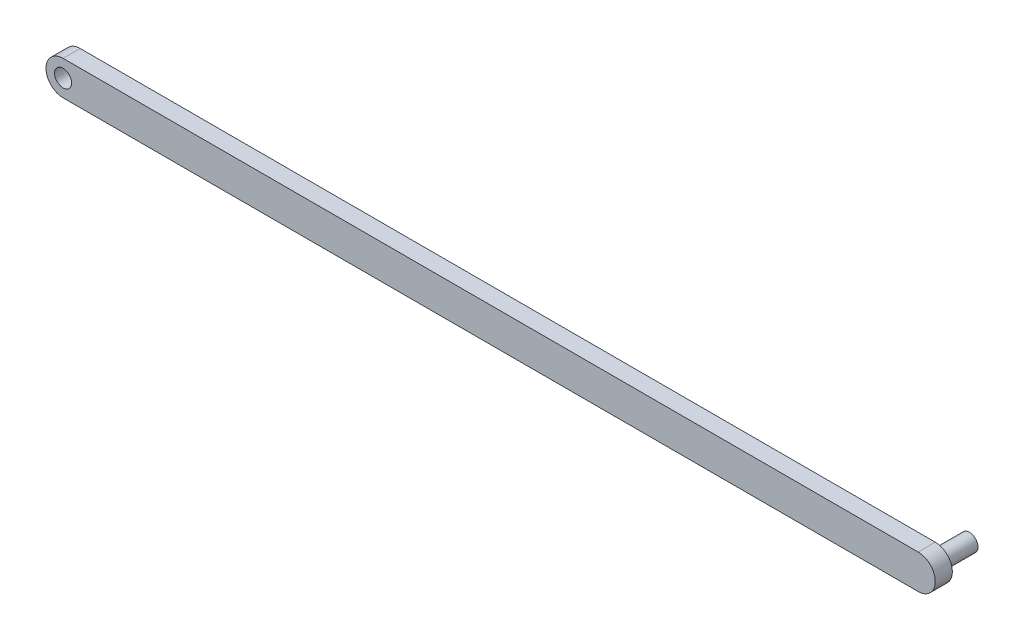
ISO-10303-21;
HEADER;
FILE_DESCRIPTION(('STEP AP214'),'2;1');
FILE_NAME('part.step','',(''),(''),'','','');
FILE_SCHEMA(('AUTOMOTIVE_DESIGN { 1 0 10303 214 1 1 1 1 }'));
ENDSEC;
DATA;
#1=APPLICATION_CONTEXT('core data for automotive mechanical design processes');
#2=APPLICATION_PROTOCOL_DEFINITION('international standard','automotive_design',2000,#1);
#3=PRODUCT_CONTEXT('',#1,'mechanical');
#4=PRODUCT('Part','Part','',(#3));
#5=PRODUCT_RELATED_PRODUCT_CATEGORY('part','',(#4));
#6=PRODUCT_DEFINITION_FORMATION('','',#4);
#7=PRODUCT_DEFINITION_CONTEXT('part definition',#1,'design');
#8=PRODUCT_DEFINITION('design','',#6,#7);
#9=PRODUCT_DEFINITION_SHAPE('','',#8);
#10=(LENGTH_UNIT() NAMED_UNIT(*) SI_UNIT(.MILLI.,.METRE.));
#11=(NAMED_UNIT(*) PLANE_ANGLE_UNIT() SI_UNIT($,.RADIAN.));
#12=(NAMED_UNIT(*) SI_UNIT($,.STERADIAN.) SOLID_ANGLE_UNIT());
#13=UNCERTAINTY_MEASURE_WITH_UNIT(LENGTH_MEASURE(1.E-05),#10,'distance_accuracy_value','');
#14=(GEOMETRIC_REPRESENTATION_CONTEXT(3) GLOBAL_UNCERTAINTY_ASSIGNED_CONTEXT((#13)) GLOBAL_UNIT_ASSIGNED_CONTEXT((#10,
#11,#12)) REPRESENTATION_CONTEXT('',''));
#15=CARTESIAN_POINT('',(0.,0.,0.));
#16=DIRECTION('',(0.,0.,1.));
#17=DIRECTION('',(1.,0.,0.));
#18=AXIS2_PLACEMENT_3D('',#15,#16,#17);
#19=CARTESIAN_POINT('',(-59.1400280952511,0.,0.));
#20=DIRECTION('',(0.,0.,1.));
#21=DIRECTION('',(1.,0.,0.));
#22=AXIS2_PLACEMENT_3D('',#19,#20,#21);
#23=PLANE('',#22);
#24=CARTESIAN_POINT('',(-59.1400280952511,0.,0.));
#25=DIRECTION('',(0.,0.,-1.));
#26=DIRECTION('',(-1.,0.,0.));
#27=AXIS2_PLACEMENT_3D('',#24,#25,#26);
#28=CIRCLE('',#27,0.999999999999998);
#29=CARTESIAN_POINT('',(-60.1400280952511,0.,0.));
#30=VERTEX_POINT('',#29);
#31=EDGE_CURVE('E198',#30,#30,#28,.T.);
#32=ORIENTED_EDGE('',*,*,#31,.F.);
#33=EDGE_LOOP('',(#32));
#34=FACE_BOUND('',#33,.T.);
#35=CARTESIAN_POINT('',(-59.1400280952511,0.,0.));
#36=DIRECTION('',(0.,0.,1.));
#37=DIRECTION('',(1.,0.,0.));
#38=AXIS2_PLACEMENT_3D('',#35,#36,#37);
#39=CIRCLE('',#38,2.);
#40=CARTESIAN_POINT('',(-59.1400280952511,2.,0.));
#41=VERTEX_POINT('',#40);
#42=CARTESIAN_POINT('',(-59.1400280952511,-2.,0.));
#43=VERTEX_POINT('',#42);
#44=EDGE_CURVE('E98',#41,#43,#39,.T.);
#45=ORIENTED_EDGE('',*,*,#44,.F.);
#46=DIRECTION('',(-1.,0.,0.));
#47=VECTOR('',#46,1.);
#48=CARTESIAN_POINT('',(-59.1400280952511,2.,0.));
#49=LINE('',#48,#47);
#50=CARTESIAN_POINT('',(40.8599719047489,2.,0.));
#51=VERTEX_POINT('',#50);
#52=EDGE_CURVE('E71',#51,#41,#49,.T.);
#53=ORIENTED_EDGE('',*,*,#52,.F.);
#54=CARTESIAN_POINT('',(40.8599719047489,0.,0.));
#55=DIRECTION('',(0.,0.,1.));
#56=DIRECTION('',(1.,0.,0.));
#57=AXIS2_PLACEMENT_3D('',#54,#55,#56);
#58=CIRCLE('',#57,2.);
#59=CARTESIAN_POINT('',(40.8599719047489,-2.,0.));
#60=VERTEX_POINT('',#59);
#61=EDGE_CURVE('E65',#60,#51,#58,.T.);
#62=ORIENTED_EDGE('',*,*,#61,.F.);
#63=DIRECTION('',(1.,0.,0.));
#64=VECTOR('',#63,1.);
#65=CARTESIAN_POINT('',(-59.1400280952511,-2.,0.));
#66=LINE('',#65,#64);
#67=EDGE_CURVE('E89',#43,#60,#66,.T.);
#68=ORIENTED_EDGE('',*,*,#67,.F.);
#69=EDGE_LOOP('',(#45,#53,#62,#68));
#70=FACE_BOUND('',#69,.T.);
#71=CARTESIAN_POINT('',(40.8599719047489,0.,0.));
#72=DIRECTION('',(0.,0.,1.));
#73=DIRECTION('',(1.,0.,0.));
#74=AXIS2_PLACEMENT_3D('',#71,#72,#73);
#75=CIRCLE('',#74,0.999999999999998);
#76=CARTESIAN_POINT('',(41.8599719047489,0.,0.));
#77=VERTEX_POINT('',#76);
#78=EDGE_CURVE('E11',#77,#77,#75,.F.);
#79=ORIENTED_EDGE('',*,*,#78,.F.);
#80=EDGE_LOOP('',(#79));
#81=FACE_BOUND('',#80,.T.);
#82=ADVANCED_FACE('F30',(#34,#70,#81),#23,.F.);
#83=CARTESIAN_POINT('',(-59.1400280952511,0.,2.));
#84=DIRECTION('',(0.,0.,-1.));
#85=DIRECTION('',(-1.,0.,0.));
#86=AXIS2_PLACEMENT_3D('',#83,#84,#85);
#87=CYLINDRICAL_SURFACE('',#86,2.);
#88=ORIENTED_EDGE('',*,*,#44,.T.);
#89=DIRECTION('',(0.,0.,-1.));
#90=VECTOR('',#89,1.);
#91=CARTESIAN_POINT('',(-59.1400280952511,-2.,2.));
#92=LINE('',#91,#90);
#93=CARTESIAN_POINT('',(-59.1400280952511,-2.,2.));
#94=VERTEX_POINT('',#93);
#95=EDGE_CURVE('E40',#94,#43,#92,.T.);
#96=ORIENTED_EDGE('',*,*,#95,.F.);
#97=CARTESIAN_POINT('',(-59.1400280952511,0.,2.));
#98=DIRECTION('',(0.,0.,1.));
#99=DIRECTION('',(1.,0.,0.));
#100=AXIS2_PLACEMENT_3D('',#97,#98,#99);
#101=CIRCLE('',#100,2.);
#102=CARTESIAN_POINT('',(-59.1400280952511,2.,2.));
#103=VERTEX_POINT('',#102);
#104=EDGE_CURVE('E84',#103,#94,#101,.T.);
#105=ORIENTED_EDGE('',*,*,#104,.F.);
#106=DIRECTION('',(0.,0.,-1.));
#107=VECTOR('',#106,1.);
#108=CARTESIAN_POINT('',(-59.1400280952511,2.,2.));
#109=LINE('',#108,#107);
#110=EDGE_CURVE('E94',#103,#41,#109,.T.);
#111=ORIENTED_EDGE('',*,*,#110,.T.);
#112=EDGE_LOOP('',(#88,#96,#105,#111));
#113=FACE_BOUND('',#112,.T.);
#114=ADVANCED_FACE('F32',(#113),#87,.T.);
#115=CARTESIAN_POINT('',(-59.1400280952511,-2.,2.));
#116=DIRECTION('',(0.,1.,0.));
#117=DIRECTION('',(0.,0.,1.));
#118=AXIS2_PLACEMENT_3D('',#115,#116,#117);
#119=PLANE('',#118);
#120=ORIENTED_EDGE('',*,*,#67,.T.);
#121=DIRECTION('',(0.,0.,-1.));
#122=VECTOR('',#121,1.);
#123=CARTESIAN_POINT('',(40.8599719047489,-2.,2.));
#124=LINE('',#123,#122);
#125=CARTESIAN_POINT('',(40.8599719047489,-2.,2.));
#126=VERTEX_POINT('',#125);
#127=EDGE_CURVE('E87',#126,#60,#124,.T.);
#128=ORIENTED_EDGE('',*,*,#127,.F.);
#129=DIRECTION('',(1.,0.,0.));
#130=VECTOR('',#129,1.);
#131=CARTESIAN_POINT('',(-59.1400280952511,-2.,2.));
#132=LINE('',#131,#130);
#133=EDGE_CURVE('E79',#94,#126,#132,.T.);
#134=ORIENTED_EDGE('',*,*,#133,.F.);
#135=ORIENTED_EDGE('',*,*,#95,.T.);
#136=EDGE_LOOP('',(#120,#128,#134,#135));
#137=FACE_BOUND('',#136,.T.);
#138=ADVANCED_FACE('F88',(#137),#119,.F.);
#139=CARTESIAN_POINT('',(40.8599719047489,0.,2.));
#140=DIRECTION('',(0.,0.,-1.));
#141=DIRECTION('',(-1.,0.,0.));
#142=AXIS2_PLACEMENT_3D('',#139,#140,#141);
#143=CYLINDRICAL_SURFACE('',#142,2.);
#144=ORIENTED_EDGE('',*,*,#61,.T.);
#145=DIRECTION('',(0.,0.,-1.));
#146=VECTOR('',#145,1.);
#147=CARTESIAN_POINT('',(40.8599719047489,2.,2.));
#148=LINE('',#147,#146);
#149=CARTESIAN_POINT('',(40.8599719047489,2.,2.));
#150=VERTEX_POINT('',#149);
#151=EDGE_CURVE('E90',#150,#51,#148,.T.);
#152=ORIENTED_EDGE('',*,*,#151,.F.);
#153=CARTESIAN_POINT('',(40.8599719047489,0.,2.));
#154=DIRECTION('',(0.,0.,1.));
#155=DIRECTION('',(1.,0.,0.));
#156=AXIS2_PLACEMENT_3D('',#153,#154,#155);
#157=CIRCLE('',#156,2.);
#158=EDGE_CURVE('E82',#126,#150,#157,.T.);
#159=ORIENTED_EDGE('',*,*,#158,.F.);
#160=ORIENTED_EDGE('',*,*,#127,.T.);
#161=EDGE_LOOP('',(#144,#152,#159,#160));
#162=FACE_BOUND('',#161,.T.);
#163=ADVANCED_FACE('F92',(#162),#143,.T.);
#164=CARTESIAN_POINT('',(-59.1400280952511,2.,2.));
#165=DIRECTION('',(0.,-1.,0.));
#166=DIRECTION('',(0.,0.,-1.));
#167=AXIS2_PLACEMENT_3D('',#164,#165,#166);
#168=PLANE('',#167);
#169=ORIENTED_EDGE('',*,*,#52,.T.);
#170=ORIENTED_EDGE('',*,*,#110,.F.);
#171=DIRECTION('',(-1.,0.,0.));
#172=VECTOR('',#171,1.);
#173=CARTESIAN_POINT('',(-59.1400280952511,2.,2.));
#174=LINE('',#173,#172);
#175=EDGE_CURVE('E48',#150,#103,#174,.T.);
#176=ORIENTED_EDGE('',*,*,#175,.F.);
#177=ORIENTED_EDGE('',*,*,#151,.T.);
#178=EDGE_LOOP('',(#169,#170,#176,#177));
#179=FACE_BOUND('',#178,.T.);
#180=ADVANCED_FACE('F128',(#179),#168,.F.);
#181=CARTESIAN_POINT('',(-59.1400280952511,0.,2.));
#182=DIRECTION('',(0.,0.,1.));
#183=DIRECTION('',(1.,0.,0.));
#184=AXIS2_PLACEMENT_3D('',#181,#182,#183);
#185=PLANE('',#184);
#186=CARTESIAN_POINT('',(-59.1400280952511,0.,2.));
#187=DIRECTION('',(0.,0.,1.));
#188=DIRECTION('',(1.,0.,0.));
#189=AXIS2_PLACEMENT_3D('',#186,#187,#188);
#190=CIRCLE('',#189,0.999999999999998);
#191=CARTESIAN_POINT('',(-58.1400280952511,0.,2.));
#192=VERTEX_POINT('',#191);
#193=EDGE_CURVE('E34',#192,#192,#190,.T.);
#194=ORIENTED_EDGE('',*,*,#193,.F.);
#195=EDGE_LOOP('',(#194));
#196=FACE_BOUND('',#195,.T.);
#197=ORIENTED_EDGE('',*,*,#104,.T.);
#198=ORIENTED_EDGE('',*,*,#133,.T.);
#199=ORIENTED_EDGE('',*,*,#158,.T.);
#200=ORIENTED_EDGE('',*,*,#175,.T.);
#201=EDGE_LOOP('',(#197,#198,#199,#200));
#202=FACE_BOUND('',#201,.T.);
#203=ADVANCED_FACE('F80',(#196,#202),#185,.T.);
#204=CARTESIAN_POINT('',(40.8599719047489,0.,-4.));
#205=DIRECTION('',(0.,0.,1.));
#206=DIRECTION('',(1.,0.,0.));
#207=AXIS2_PLACEMENT_3D('',#204,#205,#206);
#208=CYLINDRICAL_SURFACE('',#207,0.999999999999998);
#209=CARTESIAN_POINT('',(40.8599719047489,0.,-4.));
#210=DIRECTION('',(0.,0.,-1.));
#211=DIRECTION('',(-1.,0.,0.));
#212=AXIS2_PLACEMENT_3D('',#209,#210,#211);
#213=CIRCLE('',#212,0.999999999999998);
#214=CARTESIAN_POINT('',(39.8599719047489,0.,-4.));
#215=VERTEX_POINT('',#214);
#216=EDGE_CURVE('E101',#215,#215,#213,.T.);
#217=ORIENTED_EDGE('',*,*,#216,.F.);
#218=EDGE_LOOP('',(#217));
#219=FACE_BOUND('',#218,.T.);
#220=ORIENTED_EDGE('',*,*,#78,.T.);
#221=EDGE_LOOP('',(#220));
#222=FACE_BOUND('',#221,.T.);
#223=ADVANCED_FACE('F116',(#219,#222),#208,.T.);
#224=CARTESIAN_POINT('',(40.8599719047489,0.,-4.));
#225=DIRECTION('',(0.,0.,-1.));
#226=DIRECTION('',(-1.,0.,0.));
#227=AXIS2_PLACEMENT_3D('',#224,#225,#226);
#228=PLANE('',#227);
#229=ORIENTED_EDGE('',*,*,#216,.T.);
#230=EDGE_LOOP('',(#229));
#231=FACE_BOUND('',#230,.T.);
#232=ADVANCED_FACE('F118',(#231),#228,.T.);
#233=CARTESIAN_POINT('',(-59.1400280952511,0.,4.));
#234=DIRECTION('',(0.,0.,-1.));
#235=DIRECTION('',(-1.,0.,0.));
#236=AXIS2_PLACEMENT_3D('',#233,#234,#235);
#237=CYLINDRICAL_SURFACE('',#236,0.999999999999998);
#238=ORIENTED_EDGE('',*,*,#193,.T.);
#239=EDGE_LOOP('',(#238));
#240=FACE_BOUND('',#239,.T.);
#241=ORIENTED_EDGE('',*,*,#31,.T.);
#242=EDGE_LOOP('',(#241));
#243=FACE_BOUND('',#242,.T.);
#244=ADVANCED_FACE('F125',(#240,#243),#237,.F.);
#245=CLOSED_SHELL('',(#82,#114,#138,#163,#180,#203,#223,#232,#244));
#246=MANIFOLD_SOLID_BREP('B2',#245);
#247=ADVANCED_BREP_SHAPE_REPRESENTATION('',(#18,#246),#14);
#248=SHAPE_DEFINITION_REPRESENTATION(#9,#247);
ENDSEC;
END-ISO-10303-21;
